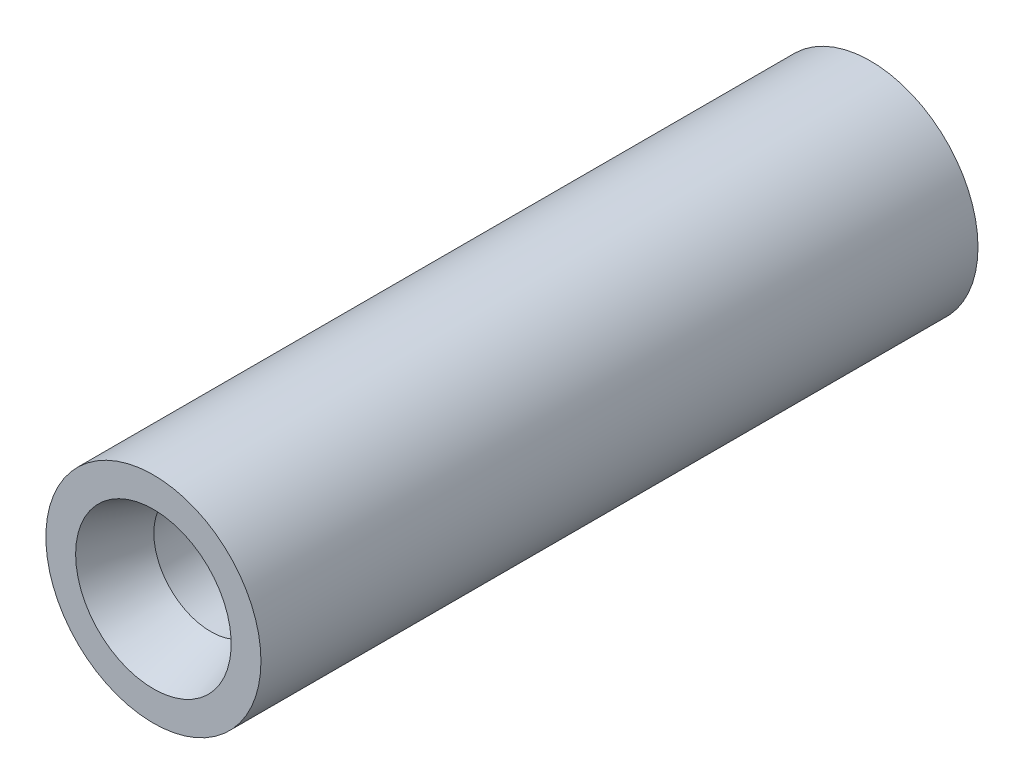
ISO-10303-21;
HEADER;
FILE_DESCRIPTION(('STEP AP214'),'2;1');
FILE_NAME('part.step','',(''),(''),'','','');
FILE_SCHEMA(('AUTOMOTIVE_DESIGN { 1 0 10303 214 1 1 1 1 }'));
ENDSEC;
DATA;
#1=APPLICATION_CONTEXT('core data for automotive mechanical design processes');
#2=APPLICATION_PROTOCOL_DEFINITION('international standard','automotive_design',2000,#1);
#3=PRODUCT_CONTEXT('',#1,'mechanical');
#4=PRODUCT('Part','Part','',(#3));
#5=PRODUCT_RELATED_PRODUCT_CATEGORY('part','',(#4));
#6=PRODUCT_DEFINITION_FORMATION('','',#4);
#7=PRODUCT_DEFINITION_CONTEXT('part definition',#1,'design');
#8=PRODUCT_DEFINITION('design','',#6,#7);
#9=PRODUCT_DEFINITION_SHAPE('','',#8);
#10=(LENGTH_UNIT() NAMED_UNIT(*) SI_UNIT(.MILLI.,.METRE.));
#11=(NAMED_UNIT(*) PLANE_ANGLE_UNIT() SI_UNIT($,.RADIAN.));
#12=(NAMED_UNIT(*) SI_UNIT($,.STERADIAN.) SOLID_ANGLE_UNIT());
#13=UNCERTAINTY_MEASURE_WITH_UNIT(LENGTH_MEASURE(1.E-05),#10,'distance_accuracy_value','');
#14=(GEOMETRIC_REPRESENTATION_CONTEXT(3) GLOBAL_UNCERTAINTY_ASSIGNED_CONTEXT((#13)) GLOBAL_UNIT_ASSIGNED_CONTEXT((#10,
#11,#12)) REPRESENTATION_CONTEXT('',''));
#15=CARTESIAN_POINT('',(0.,0.,0.));
#16=DIRECTION('',(0.,0.,1.));
#17=DIRECTION('',(1.,0.,0.));
#18=AXIS2_PLACEMENT_3D('',#15,#16,#17);
#19=CARTESIAN_POINT('',(0.,0.,100.));
#20=DIRECTION('',(0.,0.,-1.));
#21=DIRECTION('',(-1.,0.,0.));
#22=AXIS2_PLACEMENT_3D('',#19,#20,#21);
#23=CYLINDRICAL_SURFACE('',#22,15.);
#24=CARTESIAN_POINT('',(0.,0.,100.));
#25=DIRECTION('',(0.,0.,1.));
#26=DIRECTION('',(1.,0.,0.));
#27=AXIS2_PLACEMENT_3D('',#24,#25,#26);
#28=CIRCLE('',#27,15.);
#29=CARTESIAN_POINT('',(15.,0.,100.));
#30=VERTEX_POINT('',#29);
#31=EDGE_CURVE('E11',#30,#30,#28,.T.);
#32=ORIENTED_EDGE('',*,*,#31,.F.);
#33=EDGE_LOOP('',(#32));
#34=FACE_BOUND('',#33,.T.);
#35=CARTESIAN_POINT('',(0.,0.,0.));
#36=DIRECTION('',(0.,0.,1.));
#37=DIRECTION('',(1.,0.,0.));
#38=AXIS2_PLACEMENT_3D('',#35,#36,#37);
#39=CIRCLE('',#38,15.);
#40=CARTESIAN_POINT('',(15.,0.,0.));
#41=VERTEX_POINT('',#40);
#42=EDGE_CURVE('E40',#41,#41,#39,.T.);
#43=ORIENTED_EDGE('',*,*,#42,.T.);
#44=EDGE_LOOP('',(#43));
#45=FACE_BOUND('',#44,.T.);
#46=ADVANCED_FACE('F37',(#34,#45),#23,.T.);
#47=CARTESIAN_POINT('',(0.,0.,100.));
#48=DIRECTION('',(0.,0.,1.));
#49=DIRECTION('',(1.,0.,0.));
#50=AXIS2_PLACEMENT_3D('',#47,#48,#49);
#51=PLANE('',#50);
#52=CARTESIAN_POINT('',(0.,0.,100.));
#53=DIRECTION('',(0.,0.,-1.));
#54=DIRECTION('',(-1.,0.,0.));
#55=AXIS2_PLACEMENT_3D('',#52,#53,#54);
#56=CIRCLE('',#55,10.8492618741296);
#57=CARTESIAN_POINT('',(-10.8492618741296,0.,100.));
#58=VERTEX_POINT('',#57);
#59=EDGE_CURVE('E79',#58,#58,#56,.T.);
#60=ORIENTED_EDGE('',*,*,#59,.T.);
#61=EDGE_LOOP('',(#60));
#62=FACE_BOUND('',#61,.T.);
#63=ORIENTED_EDGE('',*,*,#31,.T.);
#64=EDGE_LOOP('',(#63));
#65=FACE_BOUND('',#64,.T.);
#66=ADVANCED_FACE('F59',(#62,#65),#51,.T.);
#67=CARTESIAN_POINT('',(0.,0.,0.));
#68=DIRECTION('',(0.,0.,1.));
#69=DIRECTION('',(1.,0.,0.));
#70=AXIS2_PLACEMENT_3D('',#67,#68,#69);
#71=PLANE('',#70);
#72=ORIENTED_EDGE('',*,*,#42,.F.);
#73=EDGE_LOOP('',(#72));
#74=FACE_BOUND('',#73,.T.);
#75=ADVANCED_FACE('F49',(#74),#71,.F.);
#76=CARTESIAN_POINT('',(0.,0.,66.7462833580091));
#77=DIRECTION('',(0.,0.,1.));
#78=DIRECTION('',(1.,0.,0.));
#79=AXIS2_PLACEMENT_3D('',#76,#77,#78);
#80=CONICAL_SURFACE('',#79,0.,0.986111027376791);
#81=CARTESIAN_POINT('',(0.,0.,72.));
#82=DIRECTION('',(0.,0.,-1.));
#83=DIRECTION('',(-1.,0.,0.));
#84=AXIS2_PLACEMENT_3D('',#81,#82,#83);
#85=CIRCLE('',#84,7.93749999999999);
#86=CARTESIAN_POINT('',(-7.93749999999999,0.,72.));
#87=VERTEX_POINT('',#86);
#88=EDGE_CURVE('E73',#87,#87,#85,.T.);
#89=ORIENTED_EDGE('',*,*,#88,.F.);
#90=EDGE_LOOP('',(#89));
#91=FACE_BOUND('',#90,.T.);
#92=CARTESIAN_POINT('',(0.,0.,66.7462833580091));
#93=VERTEX_POINT('',#92);
#94=VERTEX_LOOP('',#93);
#95=FACE_BOUND('',#94,.T.);
#96=ADVANCED_FACE('F46',(#91,#95),#80,.F.);
#97=CARTESIAN_POINT('',(0.,0.,0.));
#98=DIRECTION('',(0.,0.,-1.));
#99=DIRECTION('',(-1.,0.,0.));
#100=AXIS2_PLACEMENT_3D('',#97,#98,#99);
#101=CYLINDRICAL_SURFACE('',#100,7.93749999999999);
#102=CARTESIAN_POINT('',(0.,0.,92.));
#103=DIRECTION('',(0.,0.,-1.));
#104=DIRECTION('',(-1.,0.,0.));
#105=AXIS2_PLACEMENT_3D('',#102,#103,#104);
#106=CIRCLE('',#105,7.93749999999999);
#107=CARTESIAN_POINT('',(-7.93749999999999,0.,92.));
#108=VERTEX_POINT('',#107);
#109=EDGE_CURVE('E75',#108,#108,#106,.T.);
#110=ORIENTED_EDGE('',*,*,#109,.F.);
#111=EDGE_LOOP('',(#110));
#112=FACE_BOUND('',#111,.T.);
#113=ORIENTED_EDGE('',*,*,#88,.T.);
#114=EDGE_LOOP('',(#113));
#115=FACE_BOUND('',#114,.T.);
#116=ADVANCED_FACE('F48',(#112,#115),#101,.F.);
#117=CARTESIAN_POINT('',(0.,0.,92.));
#118=DIRECTION('',(0.,0.,1.));
#119=DIRECTION('',(1.,0.,0.));
#120=AXIS2_PLACEMENT_3D('',#117,#118,#119);
#121=CONICAL_SURFACE('',#120,7.93749999999999,0.349065850398867);
#122=ORIENTED_EDGE('',*,*,#59,.F.);
#123=EDGE_LOOP('',(#122));
#124=FACE_BOUND('',#123,.T.);
#125=ORIENTED_EDGE('',*,*,#109,.T.);
#126=EDGE_LOOP('',(#125));
#127=FACE_BOUND('',#126,.T.);
#128=ADVANCED_FACE('F56',(#124,#127),#121,.F.);
#129=CLOSED_SHELL('',(#46,#66,#75,#96,#116,#128));
#130=MANIFOLD_SOLID_BREP('B2',#129);
#131=ADVANCED_BREP_SHAPE_REPRESENTATION('',(#18,#130),#14);
#132=SHAPE_DEFINITION_REPRESENTATION(#9,#131);
ENDSEC;
END-ISO-10303-21;
